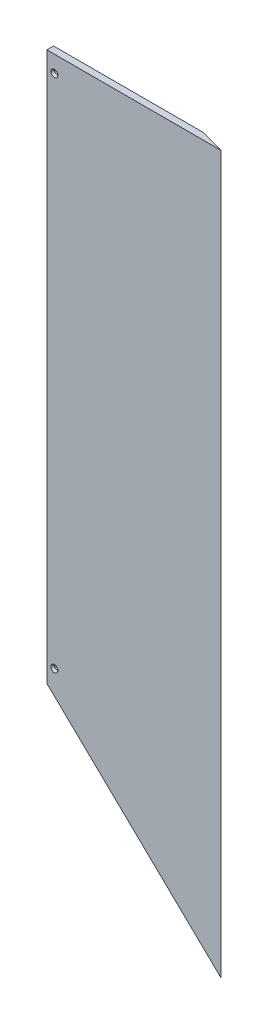
ISO-10303-21;
HEADER;
FILE_DESCRIPTION(('STEP AP214'),'2;1');
FILE_NAME('part.step','',(''),(''),'','','');
FILE_SCHEMA(('AUTOMOTIVE_DESIGN { 1 0 10303 214 1 1 1 1 }'));
ENDSEC;
DATA;
#1=APPLICATION_CONTEXT('core data for automotive mechanical design processes');
#2=APPLICATION_PROTOCOL_DEFINITION('international standard','automotive_design',2000,#1);
#3=PRODUCT_CONTEXT('',#1,'mechanical');
#4=PRODUCT('Part','Part','',(#3));
#5=PRODUCT_RELATED_PRODUCT_CATEGORY('part','',(#4));
#6=PRODUCT_DEFINITION_FORMATION('','',#4);
#7=PRODUCT_DEFINITION_CONTEXT('part definition',#1,'design');
#8=PRODUCT_DEFINITION('design','',#6,#7);
#9=PRODUCT_DEFINITION_SHAPE('','',#8);
#10=(LENGTH_UNIT() NAMED_UNIT(*) SI_UNIT(.MILLI.,.METRE.));
#11=(NAMED_UNIT(*) PLANE_ANGLE_UNIT() SI_UNIT($,.RADIAN.));
#12=(NAMED_UNIT(*) SI_UNIT($,.STERADIAN.) SOLID_ANGLE_UNIT());
#13=UNCERTAINTY_MEASURE_WITH_UNIT(LENGTH_MEASURE(1.E-05),#10,'distance_accuracy_value','');
#14=(GEOMETRIC_REPRESENTATION_CONTEXT(3) GLOBAL_UNCERTAINTY_ASSIGNED_CONTEXT((#13)) GLOBAL_UNIT_ASSIGNED_CONTEXT((#10,
#11,#12)) REPRESENTATION_CONTEXT('',''));
#15=CARTESIAN_POINT('',(0.,0.,0.));
#16=DIRECTION('',(0.,0.,1.));
#17=DIRECTION('',(1.,0.,0.));
#18=AXIS2_PLACEMENT_3D('',#15,#16,#17);
#19=CARTESIAN_POINT('',(1480.98408110292,1371.6,12.7020000000002));
#20=DIRECTION('',(0.,-1.,0.));
#21=DIRECTION('',(0.26471698178117,0.,-0.964326147917118));
#22=AXIS2_PLACEMENT_3D('',#19,#20,#21);
#23=PLANE('',#22);
#24=DIRECTION('',(-0.964326147917118,0.,-0.26471698178117));
#25=VECTOR('',#24,1.);
#26=CARTESIAN_POINT('',(61.2393104383737,1371.6,-422.666784086401));
#27=LINE('',#26,#25);
#28=CARTESIAN_POINT('',(1647.21830961026,1371.6,12.7000000000001));
#29=VERTEX_POINT('',#28);
#30=CARTESIAN_POINT('',(1600.95402389598,1371.6,1.11022302462516E-13));
#31=VERTEX_POINT('',#30);
#32=EDGE_CURVE('E111',#29,#31,#27,.T.);
#33=ORIENTED_EDGE('',*,*,#32,.T.);
#34=DIRECTION('',(1.,0.,0.));
#35=VECTOR('',#34,1.);
#36=CARTESIAN_POINT('',(1480.98408110292,1371.6,-1.11022302462516E-13));
#37=LINE('',#36,#35);
#38=CARTESIAN_POINT('',(1314.74985259558,1371.6,0.));
#39=VERTEX_POINT('',#38);
#40=EDGE_CURVE('E134',#39,#31,#37,.T.);
#41=ORIENTED_EDGE('',*,*,#40,.F.);
#42=DIRECTION('',(0.,0.,-1.));
#43=VECTOR('',#42,1.);
#44=CARTESIAN_POINT('',(1314.74985259558,1371.6,12.7019999999997));
#45=LINE('',#44,#43);
#46=CARTESIAN_POINT('',(1314.74985259558,1371.6,12.7000000000002));
#47=VERTEX_POINT('',#46);
#48=EDGE_CURVE('E112',#47,#39,#45,.T.);
#49=ORIENTED_EDGE('',*,*,#48,.F.);
#50=DIRECTION('',(1.,0.,0.));
#51=VECTOR('',#50,1.);
#52=CARTESIAN_POINT('',(1480.98408110292,1371.6,12.7));
#53=LINE('',#52,#51);
#54=EDGE_CURVE('E100',#47,#29,#53,.T.);
#55=ORIENTED_EDGE('',*,*,#54,.T.);
#56=EDGE_LOOP('',(#33,#41,#49,#55));
#57=FACE_BOUND('',#56,.T.);
#58=ADVANCED_FACE('F42',(#57),#23,.F.);
#59=CARTESIAN_POINT('',(1480.98408110292,687.420986771541,0.));
#60=DIRECTION('',(0.,0.,1.));
#61=DIRECTION('',(-1.,0.,0.));
#62=AXIS2_PLACEMENT_3D('',#59,#60,#61);
#63=PLANE('',#62);
#64=CARTESIAN_POINT('',(1329.03735259558,355.6,0.));
#65=DIRECTION('',(0.,0.,-1.));
#66=DIRECTION('',(-1.,0.,0.));
#67=AXIS2_PLACEMENT_3D('',#64,#65,#66);
#68=CIRCLE('',#67,3.3782);
#69=CARTESIAN_POINT('',(1325.65915259558,355.6,0.));
#70=VERTEX_POINT('',#69);
#71=EDGE_CURVE('E46',#70,#70,#68,.F.);
#72=ORIENTED_EDGE('',*,*,#71,.T.);
#73=EDGE_LOOP('',(#72));
#74=FACE_BOUND('',#73,.T.);
#75=CARTESIAN_POINT('',(1329.03735259558,1339.85,4.44089209850063E-13));
#76=DIRECTION('',(0.,0.,-1.));
#77=DIRECTION('',(-1.,0.,0.));
#78=AXIS2_PLACEMENT_3D('',#75,#76,#77);
#79=CIRCLE('',#78,3.3782);
#80=CARTESIAN_POINT('',(1325.65915259558,1339.85,4.44276737621152E-13));
#81=VERTEX_POINT('',#80);
#82=EDGE_CURVE('E119',#81,#81,#79,.F.);
#83=ORIENTED_EDGE('',*,*,#82,.T.);
#84=EDGE_LOOP('',(#83));
#85=FACE_BOUND('',#84,.T.);
#86=DIRECTION('',(0.,-1.,0.));
#87=VECTOR('',#86,1.);
#88=CARTESIAN_POINT('',(1600.95402389598,687.420986771541,1.11022302462516E-13));
#89=LINE('',#88,#87);
#90=CARTESIAN_POINT('',(1600.95402389598,47.8558339720756,1.66533453693773E-13));
#91=VERTEX_POINT('',#90);
#92=EDGE_CURVE('E106',#31,#91,#89,.T.);
#93=ORIENTED_EDGE('',*,*,#92,.T.);
#94=DIRECTION('',(0.719829752215674,-0.694150652110275,0.));
#95=VECTOR('',#94,1.);
#96=CARTESIAN_POINT('',(1480.98408110292,163.545986771541,1.11022302462516E-13));
#97=LINE('',#96,#95);
#98=CARTESIAN_POINT('',(1314.74985259558,323.85,0.));
#99=VERTEX_POINT('',#98);
#100=EDGE_CURVE('E131',#99,#91,#97,.T.);
#101=ORIENTED_EDGE('',*,*,#100,.F.);
#102=DIRECTION('',(0.,-1.,0.));
#103=VECTOR('',#102,1.);
#104=CARTESIAN_POINT('',(1314.74985259558,847.725,0.));
#105=LINE('',#104,#103);
#106=EDGE_CURVE('E52',#39,#99,#105,.T.);
#107=ORIENTED_EDGE('',*,*,#106,.F.);
#108=ORIENTED_EDGE('',*,*,#40,.T.);
#109=EDGE_LOOP('',(#93,#101,#107,#108));
#110=FACE_BOUND('',#109,.T.);
#111=ADVANCED_FACE('F150',(#74,#85,#110),#63,.F.);
#112=CARTESIAN_POINT('',(1480.98408110292,163.545986771541,12.7019999999999));
#113=DIRECTION('',(-0.694150652110275,-0.719829752215675,0.));
#114=DIRECTION('',(-0.706175147076652,0.680983159335232,-0.193852001158297));
#115=AXIS2_PLACEMENT_3D('',#112,#113,#114);
#116=PLANE('',#115);
#117=DIRECTION('',(0.719829752215674,-0.694150652110275,0.));
#118=VECTOR('',#117,1.);
#119=CARTESIAN_POINT('',(1480.98408110292,163.545986771541,12.6999999999998));
#120=LINE('',#119,#118);
#121=CARTESIAN_POINT('',(1314.74985259558,323.85,12.7000000000002));
#122=VERTEX_POINT('',#121);
#123=CARTESIAN_POINT('',(1647.21830961026,3.24197354308216,12.7000000000002));
#124=VERTEX_POINT('',#123);
#125=EDGE_CURVE('E103',#122,#124,#120,.T.);
#126=ORIENTED_EDGE('',*,*,#125,.F.);
#127=DIRECTION('',(0.,0.,-1.));
#128=VECTOR('',#127,1.);
#129=CARTESIAN_POINT('',(1314.74985259558,323.85,12.7019999999998));
#130=LINE('',#129,#128);
#131=EDGE_CURVE('E135',#122,#99,#130,.T.);
#132=ORIENTED_EDGE('',*,*,#131,.T.);
#133=ORIENTED_EDGE('',*,*,#100,.T.);
#134=DIRECTION('',(-0.706175147076652,0.680983159335232,-0.193852001158297));
#135=VECTOR('',#134,1.);
#136=CARTESIAN_POINT('',(1487.23120419546,157.521722624146,-31.2180289373961));
#137=LINE('',#136,#135);
#138=EDGE_CURVE('E11',#124,#91,#137,.T.);
#139=ORIENTED_EDGE('',*,*,#138,.F.);
#140=EDGE_LOOP('',(#126,#132,#133,#139));
#141=FACE_BOUND('',#140,.T.);
#142=ADVANCED_FACE('F44',(#141),#116,.T.);
#143=CARTESIAN_POINT('',(1311.38794692696,660.4,12.7000000000001));
#144=DIRECTION('',(0.,0.,1.));
#145=DIRECTION('',(0.,1.,0.));
#146=AXIS2_PLACEMENT_3D('',#143,#144,#145);
#147=PLANE('',#146);
#148=CARTESIAN_POINT('',(1329.03735259558,355.6,12.7000000000012));
#149=DIRECTION('',(0.,0.,-1.));
#150=DIRECTION('',(-1.,0.,0.));
#151=AXIS2_PLACEMENT_3D('',#148,#149,#150);
#152=CIRCLE('',#151,6.7437);
#153=CARTESIAN_POINT('',(1322.29365259558,355.6,12.7000000000012));
#154=VERTEX_POINT('',#153);
#155=EDGE_CURVE('E196',#154,#154,#152,.T.);
#156=ORIENTED_EDGE('',*,*,#155,.T.);
#157=EDGE_LOOP('',(#156));
#158=FACE_BOUND('',#157,.T.);
#159=CARTESIAN_POINT('',(1329.03735259558,1339.85,12.7000000000003));
#160=DIRECTION('',(0.,0.,-1.));
#161=DIRECTION('',(-1.,0.,0.));
#162=AXIS2_PLACEMENT_3D('',#159,#160,#161);
#163=CIRCLE('',#162,6.74369999999991);
#164=CARTESIAN_POINT('',(1322.29365259558,1339.85,12.7000000000003));
#165=VERTEX_POINT('',#164);
#166=EDGE_CURVE('E205',#165,#165,#163,.T.);
#167=ORIENTED_EDGE('',*,*,#166,.T.);
#168=EDGE_LOOP('',(#167));
#169=FACE_BOUND('',#168,.T.);
#170=DIRECTION('',(0.,-1.,0.));
#171=VECTOR('',#170,1.);
#172=CARTESIAN_POINT('',(1314.74985259558,847.725,12.7));
#173=LINE('',#172,#171);
#174=EDGE_CURVE('E114',#47,#122,#173,.T.);
#175=ORIENTED_EDGE('',*,*,#174,.T.);
#176=ORIENTED_EDGE('',*,*,#125,.T.);
#177=DIRECTION('',(0.,-1.,0.));
#178=VECTOR('',#177,1.);
#179=CARTESIAN_POINT('',(1647.21830961026,687.420986771541,12.7));
#180=LINE('',#179,#178);
#181=EDGE_CURVE('E97',#29,#124,#180,.T.);
#182=ORIENTED_EDGE('',*,*,#181,.F.);
#183=ORIENTED_EDGE('',*,*,#54,.F.);
#184=EDGE_LOOP('',(#175,#176,#182,#183));
#185=FACE_BOUND('',#184,.T.);
#186=ADVANCED_FACE('F99',(#158,#169,#185),#147,.T.);
#187=CARTESIAN_POINT('',(1314.74985259558,847.725,12.7019999999997));
#188=DIRECTION('',(-1.,0.,0.));
#189=DIRECTION('',(0.,0.,-1.));
#190=AXIS2_PLACEMENT_3D('',#187,#188,#189);
#191=PLANE('',#190);
#192=ORIENTED_EDGE('',*,*,#48,.T.);
#193=ORIENTED_EDGE('',*,*,#106,.T.);
#194=ORIENTED_EDGE('',*,*,#131,.F.);
#195=ORIENTED_EDGE('',*,*,#174,.F.);
#196=EDGE_LOOP('',(#192,#193,#194,#195));
#197=FACE_BOUND('',#196,.T.);
#198=ADVANCED_FACE('F149',(#197),#191,.T.);
#199=CARTESIAN_POINT('',(61.2393104383733,685.8,-422.666784086401));
#200=DIRECTION('',(0.26471698178117,0.,-0.964326147917118));
#201=DIRECTION('',(-0.964326147917118,0.,-0.26471698178117));
#202=AXIS2_PLACEMENT_3D('',#199,#200,#201);
#203=PLANE('',#202);
#204=ORIENTED_EDGE('',*,*,#92,.F.);
#205=ORIENTED_EDGE('',*,*,#32,.F.);
#206=ORIENTED_EDGE('',*,*,#181,.T.);
#207=ORIENTED_EDGE('',*,*,#138,.T.);
#208=EDGE_LOOP('',(#204,#205,#206,#207));
#209=FACE_BOUND('',#208,.T.);
#210=ADVANCED_FACE('F116',(#209),#203,.T.);
#211=CARTESIAN_POINT('',(1329.03735259558,1339.85,-3550.01233949683));
#212=DIRECTION('',(0.,0.,1.));
#213=DIRECTION('',(-1.,0.,0.));
#214=AXIS2_PLACEMENT_3D('',#211,#212,#213);
#215=CYLINDRICAL_SURFACE('',#214,3.3782);
#216=CARTESIAN_POINT('',(1329.03735259558,1339.85,8.8284351254978));
#217=DIRECTION('',(0.,0.,-1.));
#218=DIRECTION('',(-1.,0.,0.));
#219=AXIS2_PLACEMENT_3D('',#216,#217,#218);
#220=CIRCLE('',#219,3.3782);
#221=CARTESIAN_POINT('',(1325.65915259558,1339.85,8.8284351254978));
#222=VERTEX_POINT('',#221);
#223=EDGE_CURVE('E127',#222,#222,#220,.T.);
#224=ORIENTED_EDGE('',*,*,#223,.F.);
#225=EDGE_LOOP('',(#224));
#226=FACE_BOUND('',#225,.T.);
#227=ORIENTED_EDGE('',*,*,#82,.F.);
#228=EDGE_LOOP('',(#227));
#229=FACE_BOUND('',#228,.T.);
#230=ADVANCED_FACE('F170',(#226,#229),#215,.F.);
#231=CARTESIAN_POINT('',(1329.03735259558,1339.85,8.8284351254978));
#232=DIRECTION('',(0.,0.,1.));
#233=DIRECTION('',(-1.,0.,0.));
#234=AXIS2_PLACEMENT_3D('',#231,#232,#233);
#235=CONICAL_SURFACE('',#234,3.3782,0.715584993317624);
#236=ORIENTED_EDGE('',*,*,#166,.F.);
#237=EDGE_LOOP('',(#236));
#238=FACE_BOUND('',#237,.T.);
#239=ORIENTED_EDGE('',*,*,#223,.T.);
#240=EDGE_LOOP('',(#239));
#241=FACE_BOUND('',#240,.T.);
#242=ADVANCED_FACE('F174',(#238,#241),#235,.F.);
#243=CARTESIAN_POINT('',(1329.03735259558,355.6,-3550.01233949683));
#244=DIRECTION('',(0.,0.,1.));
#245=DIRECTION('',(-1.,0.,0.));
#246=AXIS2_PLACEMENT_3D('',#243,#244,#245);
#247=CYLINDRICAL_SURFACE('',#246,3.3782);
#248=CARTESIAN_POINT('',(1329.03735259558,355.6,8.8284351254978));
#249=DIRECTION('',(0.,0.,-1.));
#250=DIRECTION('',(-1.,0.,0.));
#251=AXIS2_PLACEMENT_3D('',#248,#249,#250);
#252=CIRCLE('',#251,3.3782);
#253=CARTESIAN_POINT('',(1325.65915259558,355.6,8.8284351254978));
#254=VERTEX_POINT('',#253);
#255=EDGE_CURVE('E199',#254,#254,#252,.T.);
#256=ORIENTED_EDGE('',*,*,#255,.F.);
#257=EDGE_LOOP('',(#256));
#258=FACE_BOUND('',#257,.T.);
#259=ORIENTED_EDGE('',*,*,#71,.F.);
#260=EDGE_LOOP('',(#259));
#261=FACE_BOUND('',#260,.T.);
#262=ADVANCED_FACE('F179',(#258,#261),#247,.F.);
#263=CARTESIAN_POINT('',(1329.03735259558,355.6,8.8284351254978));
#264=DIRECTION('',(0.,0.,1.));
#265=DIRECTION('',(-1.,0.,0.));
#266=AXIS2_PLACEMENT_3D('',#263,#264,#265);
#267=CONICAL_SURFACE('',#266,3.3782,0.715584993317523);
#268=ORIENTED_EDGE('',*,*,#155,.F.);
#269=EDGE_LOOP('',(#268));
#270=FACE_BOUND('',#269,.T.);
#271=ORIENTED_EDGE('',*,*,#255,.T.);
#272=EDGE_LOOP('',(#271));
#273=FACE_BOUND('',#272,.T.);
#274=ADVANCED_FACE('F187',(#270,#273),#267,.F.);
#275=CLOSED_SHELL('',(#58,#111,#142,#186,#198,#210,#230,#242,#262,#274));
#276=MANIFOLD_SOLID_BREP('B2',#275);
#277=ADVANCED_BREP_SHAPE_REPRESENTATION('',(#18,#276),#14);
#278=SHAPE_DEFINITION_REPRESENTATION(#9,#277);
ENDSEC;
END-ISO-10303-21;
